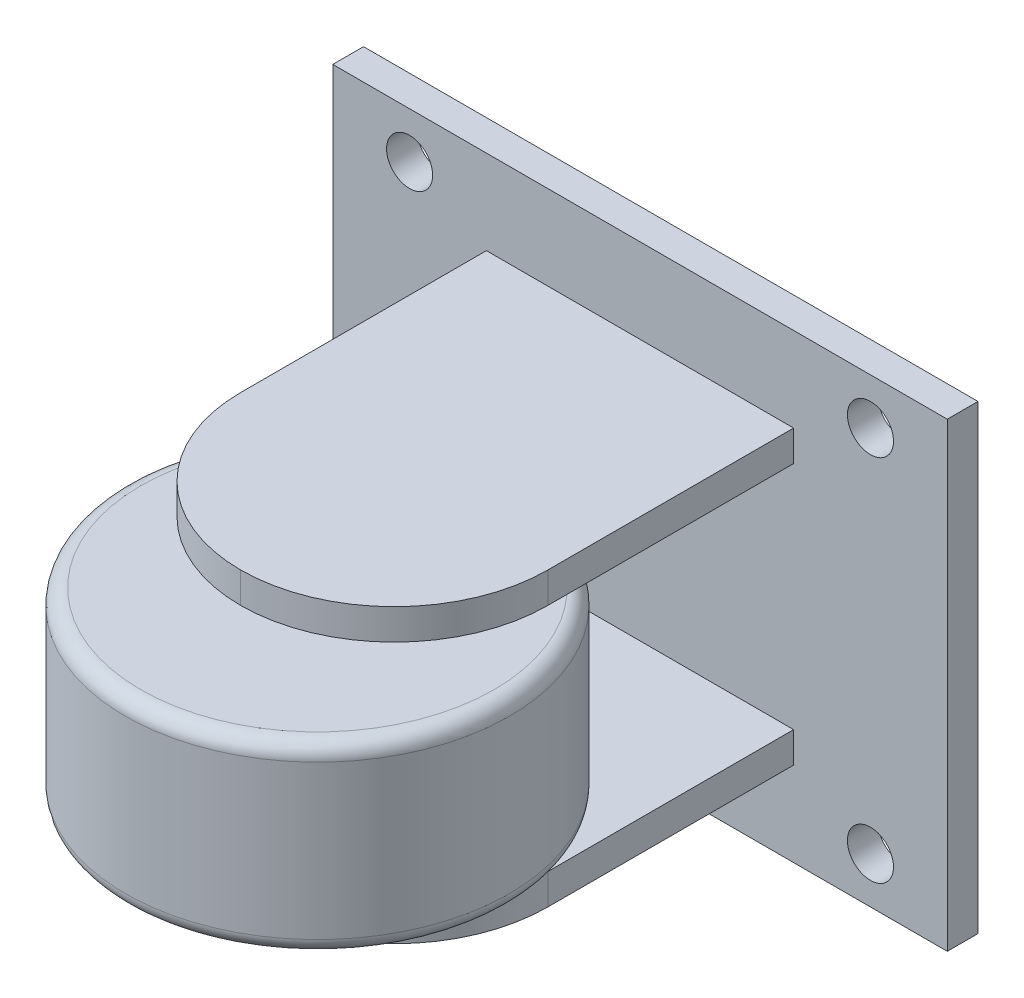
ISO-10303-21;
HEADER;
FILE_DESCRIPTION(('STEP AP214'),'2;1');
FILE_NAME('part.step','',(''),(''),'','','');
FILE_SCHEMA(('AUTOMOTIVE_DESIGN { 1 0 10303 214 1 1 1 1 }'));
ENDSEC;
DATA;
#1=APPLICATION_CONTEXT('core data for automotive mechanical design processes');
#2=APPLICATION_PROTOCOL_DEFINITION('international standard','automotive_design',2000,#1);
#3=PRODUCT_CONTEXT('',#1,'mechanical');
#4=PRODUCT('Part','Part','',(#3));
#5=PRODUCT_RELATED_PRODUCT_CATEGORY('part','',(#4));
#6=PRODUCT_DEFINITION_FORMATION('','',#4);
#7=PRODUCT_DEFINITION_CONTEXT('part definition',#1,'design');
#8=PRODUCT_DEFINITION('design','',#6,#7);
#9=PRODUCT_DEFINITION_SHAPE('','',#8);
#10=(LENGTH_UNIT() NAMED_UNIT(*) SI_UNIT(.MILLI.,.METRE.));
#11=(NAMED_UNIT(*) PLANE_ANGLE_UNIT() SI_UNIT($,.RADIAN.));
#12=(NAMED_UNIT(*) SI_UNIT($,.STERADIAN.) SOLID_ANGLE_UNIT());
#13=UNCERTAINTY_MEASURE_WITH_UNIT(LENGTH_MEASURE(1.E-05),#10,'distance_accuracy_value','');
#14=(GEOMETRIC_REPRESENTATION_CONTEXT(3) GLOBAL_UNCERTAINTY_ASSIGNED_CONTEXT((#13)) GLOBAL_UNIT_ASSIGNED_CONTEXT((#10,
#11,#12)) REPRESENTATION_CONTEXT('',''));
#15=CARTESIAN_POINT('',(0.,0.,0.));
#16=DIRECTION('',(0.,0.,1.));
#17=DIRECTION('',(1.,0.,0.));
#18=AXIS2_PLACEMENT_3D('',#15,#16,#17);
#19=CARTESIAN_POINT('',(0.,-16.5710678118655,23.));
#20=DIRECTION('',(0.,1.,0.));
#21=DIRECTION('',(0.,0.,1.));
#22=AXIS2_PLACEMENT_3D('',#19,#20,#21);
#23=CYLINDRICAL_SURFACE('',#22,2.5);
#24=CARTESIAN_POINT('',(0.,7.5,23.));
#25=DIRECTION('',(0.,1.,0.));
#26=DIRECTION('',(0.,0.,1.));
#27=AXIS2_PLACEMENT_3D('',#24,#25,#26);
#28=CIRCLE('',#27,2.5);
#29=CARTESIAN_POINT('',(0.,7.5,25.5));
#30=VERTEX_POINT('',#29);
#31=EDGE_CURVE('E241',#30,#30,#28,.T.);
#32=ORIENTED_EDGE('',*,*,#31,.F.);
#33=EDGE_LOOP('',(#32));
#34=FACE_BOUND('',#33,.T.);
#35=CARTESIAN_POINT('',(0.,6.,23.));
#36=DIRECTION('',(0.,-1.,0.));
#37=DIRECTION('',(0.,0.,-1.));
#38=AXIS2_PLACEMENT_3D('',#35,#36,#37);
#39=CIRCLE('',#38,2.5);
#40=CARTESIAN_POINT('',(0.,6.,20.5));
#41=VERTEX_POINT('',#40);
#42=EDGE_CURVE('E244',#41,#41,#39,.F.);
#43=ORIENTED_EDGE('',*,*,#42,.T.);
#44=EDGE_LOOP('',(#43));
#45=FACE_BOUND('',#44,.T.);
#46=ADVANCED_FACE('F35',(#34,#45),#23,.T.);
#47=CARTESIAN_POINT('',(0.,0.,2.));
#48=DIRECTION('',(0.,0.,-1.));
#49=DIRECTION('',(-1.,0.,0.));
#50=AXIS2_PLACEMENT_3D('',#47,#48,#49);
#51=PLANE('',#50);
#52=DIRECTION('',(0.,-1.,0.));
#53=VECTOR('',#52,1.);
#54=CARTESIAN_POINT('',(-10.,-7.5,2.));
#55=LINE('',#54,#53);
#56=CARTESIAN_POINT('',(-10.,-7.5,2.));
#57=VERTEX_POINT('',#56);
#58=CARTESIAN_POINT('',(-10.,-9.5,2.));
#59=VERTEX_POINT('',#58);
#60=EDGE_CURVE('E166',#57,#59,#55,.T.);
#61=ORIENTED_EDGE('',*,*,#60,.F.);
#62=DIRECTION('',(-1.,0.,0.));
#63=VECTOR('',#62,1.);
#64=CARTESIAN_POINT('',(-10.,-7.5,2.));
#65=LINE('',#64,#63);
#66=CARTESIAN_POINT('',(10.,-7.5,2.));
#67=VERTEX_POINT('',#66);
#68=EDGE_CURVE('E175',#67,#57,#65,.T.);
#69=ORIENTED_EDGE('',*,*,#68,.F.);
#70=DIRECTION('',(0.,1.,0.));
#71=VECTOR('',#70,1.);
#72=CARTESIAN_POINT('',(10.,-7.5,2.));
#73=LINE('',#72,#71);
#74=CARTESIAN_POINT('',(10.,-9.5,2.));
#75=VERTEX_POINT('',#74);
#76=EDGE_CURVE('E172',#75,#67,#73,.T.);
#77=ORIENTED_EDGE('',*,*,#76,.F.);
#78=DIRECTION('',(1.,0.,0.));
#79=VECTOR('',#78,1.);
#80=CARTESIAN_POINT('',(-10.,-9.5,2.));
#81=LINE('',#80,#79);
#82=EDGE_CURVE('E169',#59,#75,#81,.T.);
#83=ORIENTED_EDGE('',*,*,#82,.F.);
#84=EDGE_LOOP('',(#61,#69,#77,#83));
#85=FACE_BOUND('',#84,.T.);
#86=CARTESIAN_POINT('',(-15.,-12.,2.));
#87=DIRECTION('',(0.,0.,1.));
#88=DIRECTION('',(1.,0.,0.));
#89=AXIS2_PLACEMENT_3D('',#86,#87,#88);
#90=CIRCLE('',#89,1.5);
#91=CARTESIAN_POINT('',(-13.5,-12.,2.));
#92=VERTEX_POINT('',#91);
#93=EDGE_CURVE('E186',#92,#92,#90,.T.);
#94=ORIENTED_EDGE('',*,*,#93,.F.);
#95=EDGE_LOOP('',(#94));
#96=FACE_BOUND('',#95,.T.);
#97=CARTESIAN_POINT('',(15.,-12.,2.));
#98=DIRECTION('',(0.,0.,1.));
#99=DIRECTION('',(1.,0.,0.));
#100=AXIS2_PLACEMENT_3D('',#97,#98,#99);
#101=CIRCLE('',#100,1.5);
#102=CARTESIAN_POINT('',(16.5,-12.,2.));
#103=VERTEX_POINT('',#102);
#104=EDGE_CURVE('E197',#103,#103,#101,.T.);
#105=ORIENTED_EDGE('',*,*,#104,.F.);
#106=EDGE_LOOP('',(#105));
#107=FACE_BOUND('',#106,.T.);
#108=CARTESIAN_POINT('',(15.,12.,2.));
#109=DIRECTION('',(0.,0.,1.));
#110=DIRECTION('',(1.,0.,0.));
#111=AXIS2_PLACEMENT_3D('',#108,#109,#110);
#112=CIRCLE('',#111,1.5);
#113=CARTESIAN_POINT('',(16.5,12.,2.));
#114=VERTEX_POINT('',#113);
#115=EDGE_CURVE('E191',#114,#114,#112,.T.);
#116=ORIENTED_EDGE('',*,*,#115,.F.);
#117=EDGE_LOOP('',(#116));
#118=FACE_BOUND('',#117,.T.);
#119=CARTESIAN_POINT('',(-15.,12.,2.));
#120=DIRECTION('',(0.,0.,1.));
#121=DIRECTION('',(1.,0.,0.));
#122=AXIS2_PLACEMENT_3D('',#119,#120,#121);
#123=CIRCLE('',#122,1.5);
#124=CARTESIAN_POINT('',(-13.5,12.,2.));
#125=VERTEX_POINT('',#124);
#126=EDGE_CURVE('E190',#125,#125,#123,.T.);
#127=ORIENTED_EDGE('',*,*,#126,.F.);
#128=EDGE_LOOP('',(#127));
#129=FACE_BOUND('',#128,.T.);
#130=DIRECTION('',(0.,1.,0.));
#131=VECTOR('',#130,1.);
#132=CARTESIAN_POINT('',(20.,-15.,2.));
#133=LINE('',#132,#131);
#134=CARTESIAN_POINT('',(20.,-15.,2.));
#135=VERTEX_POINT('',#134);
#136=CARTESIAN_POINT('',(20.,15.,2.));
#137=VERTEX_POINT('',#136);
#138=EDGE_CURVE('E211',#135,#137,#133,.T.);
#139=ORIENTED_EDGE('',*,*,#138,.T.);
#140=DIRECTION('',(-1.,0.,0.));
#141=VECTOR('',#140,1.);
#142=CARTESIAN_POINT('',(-20.,15.,2.));
#143=LINE('',#142,#141);
#144=CARTESIAN_POINT('',(-20.,15.,2.));
#145=VERTEX_POINT('',#144);
#146=EDGE_CURVE('E214',#137,#145,#143,.T.);
#147=ORIENTED_EDGE('',*,*,#146,.T.);
#148=DIRECTION('',(0.,-1.,0.));
#149=VECTOR('',#148,1.);
#150=CARTESIAN_POINT('',(-20.,-15.,2.));
#151=LINE('',#150,#149);
#152=CARTESIAN_POINT('',(-20.,-15.,2.));
#153=VERTEX_POINT('',#152);
#154=EDGE_CURVE('E217',#145,#153,#151,.T.);
#155=ORIENTED_EDGE('',*,*,#154,.T.);
#156=DIRECTION('',(1.,0.,0.));
#157=VECTOR('',#156,1.);
#158=CARTESIAN_POINT('',(-20.,-15.,2.));
#159=LINE('',#158,#157);
#160=EDGE_CURVE('E219',#153,#135,#159,.T.);
#161=ORIENTED_EDGE('',*,*,#160,.T.);
#162=EDGE_LOOP('',(#139,#147,#155,#161));
#163=FACE_BOUND('',#162,.T.);
#164=DIRECTION('',(0.,1.,0.));
#165=VECTOR('',#164,1.);
#166=CARTESIAN_POINT('',(10.,7.5,2.));
#167=LINE('',#166,#165);
#168=CARTESIAN_POINT('',(10.,7.5,2.));
#169=VERTEX_POINT('',#168);
#170=CARTESIAN_POINT('',(10.,9.5,2.));
#171=VERTEX_POINT('',#170);
#172=EDGE_CURVE('E138',#169,#171,#167,.T.);
#173=ORIENTED_EDGE('',*,*,#172,.F.);
#174=DIRECTION('',(1.,0.,0.));
#175=VECTOR('',#174,1.);
#176=CARTESIAN_POINT('',(10.,7.5,2.));
#177=LINE('',#176,#175);
#178=CARTESIAN_POINT('',(-10.,7.5,2.));
#179=VERTEX_POINT('',#178);
#180=EDGE_CURVE('E143',#179,#169,#177,.T.);
#181=ORIENTED_EDGE('',*,*,#180,.F.);
#182=DIRECTION('',(0.,-1.,0.));
#183=VECTOR('',#182,1.);
#184=CARTESIAN_POINT('',(-10.,7.5,2.));
#185=LINE('',#184,#183);
#186=CARTESIAN_POINT('',(-10.,9.5,2.));
#187=VERTEX_POINT('',#186);
#188=EDGE_CURVE('E156',#187,#179,#185,.T.);
#189=ORIENTED_EDGE('',*,*,#188,.F.);
#190=DIRECTION('',(-1.,0.,0.));
#191=VECTOR('',#190,1.);
#192=CARTESIAN_POINT('',(10.,9.5,2.));
#193=LINE('',#192,#191);
#194=EDGE_CURVE('E152',#171,#187,#193,.T.);
#195=ORIENTED_EDGE('',*,*,#194,.F.);
#196=EDGE_LOOP('',(#173,#181,#189,#195));
#197=FACE_BOUND('',#196,.T.);
#198=ADVANCED_FACE('F148',(#85,#96,#107,#118,#129,#163,#197),#51,.F.);
#199=CARTESIAN_POINT('',(20.,-15.,2.));
#200=DIRECTION('',(-1.,0.,0.));
#201=DIRECTION('',(0.,0.,1.));
#202=AXIS2_PLACEMENT_3D('',#199,#200,#201);
#203=PLANE('',#202);
#204=DIRECTION('',(0.,1.,0.));
#205=VECTOR('',#204,1.);
#206=CARTESIAN_POINT('',(20.,-15.,0.));
#207=LINE('',#206,#205);
#208=CARTESIAN_POINT('',(20.,-15.,0.));
#209=VERTEX_POINT('',#208);
#210=CARTESIAN_POINT('',(20.,15.,0.));
#211=VERTEX_POINT('',#210);
#212=EDGE_CURVE('E208',#209,#211,#207,.T.);
#213=ORIENTED_EDGE('',*,*,#212,.T.);
#214=DIRECTION('',(0.,0.,-1.));
#215=VECTOR('',#214,1.);
#216=CARTESIAN_POINT('',(20.,15.,2.));
#217=LINE('',#216,#215);
#218=EDGE_CURVE('E237',#137,#211,#217,.T.);
#219=ORIENTED_EDGE('',*,*,#218,.F.);
#220=ORIENTED_EDGE('',*,*,#138,.F.);
#221=DIRECTION('',(0.,0.,-1.));
#222=VECTOR('',#221,1.);
#223=CARTESIAN_POINT('',(20.,-15.,2.));
#224=LINE('',#223,#222);
#225=EDGE_CURVE('E221',#135,#209,#224,.T.);
#226=ORIENTED_EDGE('',*,*,#225,.T.);
#227=EDGE_LOOP('',(#213,#219,#220,#226));
#228=FACE_BOUND('',#227,.T.);
#229=ADVANCED_FACE('F335',(#228),#203,.F.);
#230=CARTESIAN_POINT('',(-20.,15.,2.));
#231=DIRECTION('',(0.,-1.,0.));
#232=DIRECTION('',(0.,0.,-1.));
#233=AXIS2_PLACEMENT_3D('',#230,#231,#232);
#234=PLANE('',#233);
#235=DIRECTION('',(-1.,0.,0.));
#236=VECTOR('',#235,1.);
#237=CARTESIAN_POINT('',(-20.,15.,0.));
#238=LINE('',#237,#236);
#239=CARTESIAN_POINT('',(-20.,15.,0.));
#240=VERTEX_POINT('',#239);
#241=EDGE_CURVE('E224',#211,#240,#238,.T.);
#242=ORIENTED_EDGE('',*,*,#241,.T.);
#243=DIRECTION('',(0.,0.,-1.));
#244=VECTOR('',#243,1.);
#245=CARTESIAN_POINT('',(-20.,15.,2.));
#246=LINE('',#245,#244);
#247=EDGE_CURVE('E234',#145,#240,#246,.T.);
#248=ORIENTED_EDGE('',*,*,#247,.F.);
#249=ORIENTED_EDGE('',*,*,#146,.F.);
#250=ORIENTED_EDGE('',*,*,#218,.T.);
#251=EDGE_LOOP('',(#242,#248,#249,#250));
#252=FACE_BOUND('',#251,.T.);
#253=ADVANCED_FACE('F541',(#252),#234,.F.);
#254=CARTESIAN_POINT('',(-20.,-15.,2.));
#255=DIRECTION('',(1.,0.,0.));
#256=DIRECTION('',(0.,0.,-1.));
#257=AXIS2_PLACEMENT_3D('',#254,#255,#256);
#258=PLANE('',#257);
#259=DIRECTION('',(0.,-1.,0.));
#260=VECTOR('',#259,1.);
#261=CARTESIAN_POINT('',(-20.,-15.,0.));
#262=LINE('',#261,#260);
#263=CARTESIAN_POINT('',(-20.,-15.,0.));
#264=VERTEX_POINT('',#263);
#265=EDGE_CURVE('E226',#240,#264,#262,.T.);
#266=ORIENTED_EDGE('',*,*,#265,.T.);
#267=DIRECTION('',(0.,0.,-1.));
#268=VECTOR('',#267,1.);
#269=CARTESIAN_POINT('',(-20.,-15.,2.));
#270=LINE('',#269,#268);
#271=EDGE_CURVE('E231',#153,#264,#270,.T.);
#272=ORIENTED_EDGE('',*,*,#271,.F.);
#273=ORIENTED_EDGE('',*,*,#154,.F.);
#274=ORIENTED_EDGE('',*,*,#247,.T.);
#275=EDGE_LOOP('',(#266,#272,#273,#274));
#276=FACE_BOUND('',#275,.T.);
#277=ADVANCED_FACE('F531',(#276),#258,.F.);
#278=CARTESIAN_POINT('',(-20.,-15.,2.));
#279=DIRECTION('',(0.,1.,0.));
#280=DIRECTION('',(0.,0.,1.));
#281=AXIS2_PLACEMENT_3D('',#278,#279,#280);
#282=PLANE('',#281);
#283=DIRECTION('',(1.,0.,0.));
#284=VECTOR('',#283,1.);
#285=CARTESIAN_POINT('',(-20.,-15.,0.));
#286=LINE('',#285,#284);
#287=EDGE_CURVE('E215',#264,#209,#286,.T.);
#288=ORIENTED_EDGE('',*,*,#287,.T.);
#289=ORIENTED_EDGE('',*,*,#225,.F.);
#290=ORIENTED_EDGE('',*,*,#160,.F.);
#291=ORIENTED_EDGE('',*,*,#271,.T.);
#292=EDGE_LOOP('',(#288,#289,#290,#291));
#293=FACE_BOUND('',#292,.T.);
#294=ADVANCED_FACE('F521',(#293),#282,.F.);
#295=CARTESIAN_POINT('',(0.,0.,0.));
#296=DIRECTION('',(0.,0.,-1.));
#297=DIRECTION('',(-1.,0.,0.));
#298=AXIS2_PLACEMENT_3D('',#295,#296,#297);
#299=PLANE('',#298);
#300=CARTESIAN_POINT('',(-15.,-12.,0.));
#301=DIRECTION('',(0.,0.,1.));
#302=DIRECTION('',(1.,0.,0.));
#303=AXIS2_PLACEMENT_3D('',#300,#301,#302);
#304=CIRCLE('',#303,1.5);
#305=CARTESIAN_POINT('',(-13.5,-12.,0.));
#306=VERTEX_POINT('',#305);
#307=EDGE_CURVE('E200',#306,#306,#304,.T.);
#308=ORIENTED_EDGE('',*,*,#307,.T.);
#309=EDGE_LOOP('',(#308));
#310=FACE_BOUND('',#309,.T.);
#311=CARTESIAN_POINT('',(15.,-12.,0.));
#312=DIRECTION('',(0.,0.,1.));
#313=DIRECTION('',(1.,0.,0.));
#314=AXIS2_PLACEMENT_3D('',#311,#312,#313);
#315=CIRCLE('',#314,1.5);
#316=CARTESIAN_POINT('',(16.5,-12.,0.));
#317=VERTEX_POINT('',#316);
#318=EDGE_CURVE('E194',#317,#317,#315,.T.);
#319=ORIENTED_EDGE('',*,*,#318,.T.);
#320=EDGE_LOOP('',(#319));
#321=FACE_BOUND('',#320,.T.);
#322=CARTESIAN_POINT('',(15.,12.,0.));
#323=DIRECTION('',(0.,0.,1.));
#324=DIRECTION('',(1.,0.,0.));
#325=AXIS2_PLACEMENT_3D('',#322,#323,#324);
#326=CIRCLE('',#325,1.5);
#327=CARTESIAN_POINT('',(16.5,12.,0.));
#328=VERTEX_POINT('',#327);
#329=EDGE_CURVE('E187',#328,#328,#326,.T.);
#330=ORIENTED_EDGE('',*,*,#329,.T.);
#331=EDGE_LOOP('',(#330));
#332=FACE_BOUND('',#331,.T.);
#333=CARTESIAN_POINT('',(-15.,12.,0.));
#334=DIRECTION('',(0.,0.,1.));
#335=DIRECTION('',(1.,0.,0.));
#336=AXIS2_PLACEMENT_3D('',#333,#334,#335);
#337=CIRCLE('',#336,1.5);
#338=CARTESIAN_POINT('',(-13.5,12.,0.));
#339=VERTEX_POINT('',#338);
#340=EDGE_CURVE('E205',#339,#339,#337,.T.);
#341=ORIENTED_EDGE('',*,*,#340,.T.);
#342=EDGE_LOOP('',(#341));
#343=FACE_BOUND('',#342,.T.);
#344=ORIENTED_EDGE('',*,*,#212,.F.);
#345=ORIENTED_EDGE('',*,*,#287,.F.);
#346=ORIENTED_EDGE('',*,*,#265,.F.);
#347=ORIENTED_EDGE('',*,*,#241,.F.);
#348=EDGE_LOOP('',(#344,#345,#346,#347));
#349=FACE_BOUND('',#348,.T.);
#350=ADVANCED_FACE('F511',(#310,#321,#332,#343,#349),#299,.T.);
#351=CARTESIAN_POINT('',(-15.,12.,0.));
#352=DIRECTION('',(0.,0.,1.));
#353=DIRECTION('',(1.,0.,0.));
#354=AXIS2_PLACEMENT_3D('',#351,#352,#353);
#355=CYLINDRICAL_SURFACE('',#354,1.5);
#356=ORIENTED_EDGE('',*,*,#340,.F.);
#357=EDGE_LOOP('',(#356));
#358=FACE_BOUND('',#357,.T.);
#359=ORIENTED_EDGE('',*,*,#126,.T.);
#360=EDGE_LOOP('',(#359));
#361=FACE_BOUND('',#360,.T.);
#362=ADVANCED_FACE('F501',(#358,#361),#355,.F.);
#363=CARTESIAN_POINT('',(15.,12.,0.));
#364=DIRECTION('',(0.,0.,1.));
#365=DIRECTION('',(1.,0.,0.));
#366=AXIS2_PLACEMENT_3D('',#363,#364,#365);
#367=CYLINDRICAL_SURFACE('',#366,1.5);
#368=ORIENTED_EDGE('',*,*,#329,.F.);
#369=EDGE_LOOP('',(#368));
#370=FACE_BOUND('',#369,.T.);
#371=ORIENTED_EDGE('',*,*,#115,.T.);
#372=EDGE_LOOP('',(#371));
#373=FACE_BOUND('',#372,.T.);
#374=ADVANCED_FACE('F491',(#370,#373),#367,.F.);
#375=CARTESIAN_POINT('',(15.,-12.,0.));
#376=DIRECTION('',(0.,0.,1.));
#377=DIRECTION('',(1.,0.,0.));
#378=AXIS2_PLACEMENT_3D('',#375,#376,#377);
#379=CYLINDRICAL_SURFACE('',#378,1.5);
#380=ORIENTED_EDGE('',*,*,#318,.F.);
#381=EDGE_LOOP('',(#380));
#382=FACE_BOUND('',#381,.T.);
#383=ORIENTED_EDGE('',*,*,#104,.T.);
#384=EDGE_LOOP('',(#383));
#385=FACE_BOUND('',#384,.T.);
#386=ADVANCED_FACE('F481',(#382,#385),#379,.F.);
#387=CARTESIAN_POINT('',(-15.,-12.,0.));
#388=DIRECTION('',(0.,0.,1.));
#389=DIRECTION('',(1.,0.,0.));
#390=AXIS2_PLACEMENT_3D('',#387,#388,#389);
#391=CYLINDRICAL_SURFACE('',#390,1.5);
#392=ORIENTED_EDGE('',*,*,#307,.F.);
#393=EDGE_LOOP('',(#392));
#394=FACE_BOUND('',#393,.T.);
#395=ORIENTED_EDGE('',*,*,#93,.T.);
#396=EDGE_LOOP('',(#395));
#397=FACE_BOUND('',#396,.T.);
#398=ADVANCED_FACE('F454',(#394,#397),#391,.F.);
#399=CARTESIAN_POINT('',(-10.,-7.5,28.));
#400=DIRECTION('',(1.,0.,0.));
#401=DIRECTION('',(0.,0.,-1.));
#402=AXIS2_PLACEMENT_3D('',#399,#400,#401);
#403=PLANE('',#402);
#404=DIRECTION('',(0.,0.,-1.));
#405=VECTOR('',#404,1.);
#406=CARTESIAN_POINT('',(-10.,-9.5,28.));
#407=LINE('',#406,#405);
#408=CARTESIAN_POINT('',(-10.,-9.5,18.));
#409=VERTEX_POINT('',#408);
#410=EDGE_CURVE('E184',#409,#59,#407,.T.);
#411=ORIENTED_EDGE('',*,*,#410,.F.);
#412=DIRECTION('',(0.,-1.,0.));
#413=VECTOR('',#412,1.);
#414=CARTESIAN_POINT('',(-9.99999999999999,-7.5,18.));
#415=LINE('',#414,#413);
#416=CARTESIAN_POINT('',(-10.,-7.5,18.));
#417=VERTEX_POINT('',#416);
#418=EDGE_CURVE('E261',#409,#417,#415,.F.);
#419=ORIENTED_EDGE('',*,*,#418,.T.);
#420=DIRECTION('',(0.,0.,-1.));
#421=VECTOR('',#420,1.);
#422=CARTESIAN_POINT('',(-10.,-7.5,28.));
#423=LINE('',#422,#421);
#424=EDGE_CURVE('E178',#417,#57,#423,.T.);
#425=ORIENTED_EDGE('',*,*,#424,.T.);
#426=ORIENTED_EDGE('',*,*,#60,.T.);
#427=EDGE_LOOP('',(#411,#419,#425,#426));
#428=FACE_BOUND('',#427,.T.);
#429=ADVANCED_FACE('F444',(#428),#403,.F.);
#430=CARTESIAN_POINT('',(-10.,-9.5,28.));
#431=DIRECTION('',(0.,1.,0.));
#432=DIRECTION('',(0.,0.,1.));
#433=AXIS2_PLACEMENT_3D('',#430,#431,#432);
#434=PLANE('',#433);
#435=DIRECTION('',(0.,0.,-1.));
#436=VECTOR('',#435,1.);
#437=CARTESIAN_POINT('',(10.,-9.5,28.));
#438=LINE('',#437,#436);
#439=CARTESIAN_POINT('',(10.,-9.5,18.));
#440=VERTEX_POINT('',#439);
#441=EDGE_CURVE('E182',#440,#75,#438,.T.);
#442=ORIENTED_EDGE('',*,*,#441,.F.);
#443=CARTESIAN_POINT('',(0.,-9.5,18.));
#444=DIRECTION('',(0.,1.,0.));
#445=DIRECTION('',(0.,0.,1.));
#446=AXIS2_PLACEMENT_3D('',#443,#444,#445);
#447=CIRCLE('',#446,10.);
#448=CARTESIAN_POINT('',(0.,-9.5,28.));
#449=VERTEX_POINT('',#448);
#450=EDGE_CURVE('E259',#440,#449,#447,.F.);
#451=ORIENTED_EDGE('',*,*,#450,.T.);
#452=CARTESIAN_POINT('',(0.,-9.5,18.));
#453=DIRECTION('',(0.,1.,0.));
#454=DIRECTION('',(0.,0.,1.));
#455=AXIS2_PLACEMENT_3D('',#452,#453,#454);
#456=CIRCLE('',#455,10.);
#457=EDGE_CURVE('E257',#449,#409,#456,.F.);
#458=ORIENTED_EDGE('',*,*,#457,.T.);
#459=ORIENTED_EDGE('',*,*,#410,.T.);
#460=ORIENTED_EDGE('',*,*,#82,.T.);
#461=EDGE_LOOP('',(#442,#451,#458,#459,#460));
#462=FACE_BOUND('',#461,.T.);
#463=ADVANCED_FACE('F434',(#462),#434,.F.);
#464=CARTESIAN_POINT('',(10.,-7.5,28.));
#465=DIRECTION('',(-1.,0.,0.));
#466=DIRECTION('',(0.,0.,1.));
#467=AXIS2_PLACEMENT_3D('',#464,#465,#466);
#468=PLANE('',#467);
#469=DIRECTION('',(0.,0.,-1.));
#470=VECTOR('',#469,1.);
#471=CARTESIAN_POINT('',(10.,-7.5,28.));
#472=LINE('',#471,#470);
#473=CARTESIAN_POINT('',(10.,-7.5,18.));
#474=VERTEX_POINT('',#473);
#475=EDGE_CURVE('E180',#474,#67,#472,.T.);
#476=ORIENTED_EDGE('',*,*,#475,.F.);
#477=DIRECTION('',(0.,1.,0.));
#478=VECTOR('',#477,1.);
#479=CARTESIAN_POINT('',(10.,-9.5,18.));
#480=LINE('',#479,#478);
#481=EDGE_CURVE('E254',#474,#440,#480,.F.);
#482=ORIENTED_EDGE('',*,*,#481,.T.);
#483=ORIENTED_EDGE('',*,*,#441,.T.);
#484=ORIENTED_EDGE('',*,*,#76,.T.);
#485=EDGE_LOOP('',(#476,#482,#483,#484));
#486=FACE_BOUND('',#485,.T.);
#487=ADVANCED_FACE('F425',(#486),#468,.F.);
#488=CARTESIAN_POINT('',(-10.,-7.5,28.));
#489=DIRECTION('',(0.,-1.,0.));
#490=DIRECTION('',(0.,0.,-1.));
#491=AXIS2_PLACEMENT_3D('',#488,#489,#490);
#492=PLANE('',#491);
#493=CARTESIAN_POINT('',(0.,-7.5,23.));
#494=DIRECTION('',(0.,-1.,0.));
#495=DIRECTION('',(0.,0.,-1.));
#496=AXIS2_PLACEMENT_3D('',#493,#494,#495);
#497=CIRCLE('',#496,2.5);
#498=CARTESIAN_POINT('',(0.,-7.5,20.5));
#499=VERTEX_POINT('',#498);
#500=EDGE_CURVE('E153',#499,#499,#497,.T.);
#501=ORIENTED_EDGE('',*,*,#500,.T.);
#502=EDGE_LOOP('',(#501));
#503=FACE_BOUND('',#502,.T.);
#504=CARTESIAN_POINT('',(0.,-7.5,18.));
#505=DIRECTION('',(0.,-1.,0.));
#506=DIRECTION('',(0.,0.,-1.));
#507=AXIS2_PLACEMENT_3D('',#504,#505,#506);
#508=CIRCLE('',#507,10.);
#509=CARTESIAN_POINT('',(0.,-7.5,28.));
#510=VERTEX_POINT('',#509);
#511=EDGE_CURVE('E250',#417,#510,#508,.F.);
#512=ORIENTED_EDGE('',*,*,#511,.T.);
#513=CARTESIAN_POINT('',(0.,-7.5,18.));
#514=DIRECTION('',(0.,-1.,0.));
#515=DIRECTION('',(0.,0.,-1.));
#516=AXIS2_PLACEMENT_3D('',#513,#514,#515);
#517=CIRCLE('',#516,10.);
#518=EDGE_CURVE('E252',#510,#474,#517,.F.);
#519=ORIENTED_EDGE('',*,*,#518,.T.);
#520=ORIENTED_EDGE('',*,*,#475,.T.);
#521=ORIENTED_EDGE('',*,*,#68,.T.);
#522=ORIENTED_EDGE('',*,*,#424,.F.);
#523=EDGE_LOOP('',(#512,#519,#520,#521,#522));
#524=FACE_BOUND('',#523,.T.);
#525=ADVANCED_FACE('F416',(#503,#524),#492,.F.);
#526=CARTESIAN_POINT('',(10.,7.5,28.));
#527=DIRECTION('',(-1.,0.,0.));
#528=DIRECTION('',(0.,0.,1.));
#529=AXIS2_PLACEMENT_3D('',#526,#527,#528);
#530=PLANE('',#529);
#531=DIRECTION('',(0.,0.,-1.));
#532=VECTOR('',#531,1.);
#533=CARTESIAN_POINT('',(10.,9.5,28.));
#534=LINE('',#533,#532);
#535=CARTESIAN_POINT('',(10.,9.5,18.));
#536=VERTEX_POINT('',#535);
#537=EDGE_CURVE('E164',#536,#171,#534,.T.);
#538=ORIENTED_EDGE('',*,*,#537,.F.);
#539=DIRECTION('',(0.,1.,0.));
#540=VECTOR('',#539,1.);
#541=CARTESIAN_POINT('',(10.,7.5,18.));
#542=LINE('',#541,#540);
#543=CARTESIAN_POINT('',(10.,7.5,18.));
#544=VERTEX_POINT('',#543);
#545=EDGE_CURVE('E140',#536,#544,#542,.F.);
#546=ORIENTED_EDGE('',*,*,#545,.T.);
#547=DIRECTION('',(0.,0.,-1.));
#548=VECTOR('',#547,1.);
#549=CARTESIAN_POINT('',(10.,7.5,28.));
#550=LINE('',#549,#548);
#551=EDGE_CURVE('E134',#544,#169,#550,.T.);
#552=ORIENTED_EDGE('',*,*,#551,.T.);
#553=ORIENTED_EDGE('',*,*,#172,.T.);
#554=EDGE_LOOP('',(#538,#546,#552,#553));
#555=FACE_BOUND('',#554,.T.);
#556=ADVANCED_FACE('F137',(#555),#530,.F.);
#557=CARTESIAN_POINT('',(10.,9.5,28.));
#558=DIRECTION('',(0.,-1.,0.));
#559=DIRECTION('',(0.,0.,-1.));
#560=AXIS2_PLACEMENT_3D('',#557,#558,#559);
#561=PLANE('',#560);
#562=CARTESIAN_POINT('',(0.,9.5,18.));
#563=DIRECTION('',(0.,-1.,0.));
#564=DIRECTION('',(0.,0.,-1.));
#565=AXIS2_PLACEMENT_3D('',#562,#563,#564);
#566=CIRCLE('',#565,10.);
#567=CARTESIAN_POINT('',(-10.,9.5,18.));
#568=VERTEX_POINT('',#567);
#569=CARTESIAN_POINT('',(0.,9.5,28.));
#570=VERTEX_POINT('',#569);
#571=EDGE_CURVE('E263',#568,#570,#566,.F.);
#572=ORIENTED_EDGE('',*,*,#571,.T.);
#573=CARTESIAN_POINT('',(0.,9.5,18.));
#574=DIRECTION('',(0.,-1.,0.));
#575=DIRECTION('',(0.,0.,-1.));
#576=AXIS2_PLACEMENT_3D('',#573,#574,#575);
#577=CIRCLE('',#576,10.);
#578=EDGE_CURVE('E265',#570,#536,#577,.F.);
#579=ORIENTED_EDGE('',*,*,#578,.T.);
#580=ORIENTED_EDGE('',*,*,#537,.T.);
#581=ORIENTED_EDGE('',*,*,#194,.T.);
#582=DIRECTION('',(0.,0.,-1.));
#583=VECTOR('',#582,1.);
#584=CARTESIAN_POINT('',(-10.,9.5,28.));
#585=LINE('',#584,#583);
#586=EDGE_CURVE('E162',#568,#187,#585,.T.);
#587=ORIENTED_EDGE('',*,*,#586,.F.);
#588=EDGE_LOOP('',(#572,#579,#580,#581,#587));
#589=FACE_BOUND('',#588,.T.);
#590=ADVANCED_FACE('F311',(#589),#561,.F.);
#591=CARTESIAN_POINT('',(-10.,7.5,28.));
#592=DIRECTION('',(1.,0.,0.));
#593=DIRECTION('',(0.,0.,-1.));
#594=AXIS2_PLACEMENT_3D('',#591,#592,#593);
#595=PLANE('',#594);
#596=DIRECTION('',(0.,0.,-1.));
#597=VECTOR('',#596,1.);
#598=CARTESIAN_POINT('',(-10.,7.5,28.));
#599=LINE('',#598,#597);
#600=CARTESIAN_POINT('',(-10.,7.5,18.));
#601=VERTEX_POINT('',#600);
#602=EDGE_CURVE('E142',#601,#179,#599,.T.);
#603=ORIENTED_EDGE('',*,*,#602,.F.);
#604=DIRECTION('',(0.,-1.,0.));
#605=VECTOR('',#604,1.);
#606=CARTESIAN_POINT('',(-10.,9.5,18.));
#607=LINE('',#606,#605);
#608=EDGE_CURVE('E270',#601,#568,#607,.F.);
#609=ORIENTED_EDGE('',*,*,#608,.T.);
#610=ORIENTED_EDGE('',*,*,#586,.T.);
#611=ORIENTED_EDGE('',*,*,#188,.T.);
#612=EDGE_LOOP('',(#603,#609,#610,#611));
#613=FACE_BOUND('',#612,.T.);
#614=ADVANCED_FACE('F320',(#613),#595,.F.);
#615=CARTESIAN_POINT('',(10.,7.5,28.));
#616=DIRECTION('',(0.,1.,0.));
#617=DIRECTION('',(0.,0.,1.));
#618=AXIS2_PLACEMENT_3D('',#615,#616,#617);
#619=PLANE('',#618);
#620=ORIENTED_EDGE('',*,*,#31,.T.);
#621=EDGE_LOOP('',(#620));
#622=FACE_BOUND('',#621,.T.);
#623=ORIENTED_EDGE('',*,*,#551,.F.);
#624=CARTESIAN_POINT('',(0.,7.5,18.));
#625=DIRECTION('',(0.,1.,0.));
#626=DIRECTION('',(0.,0.,1.));
#627=AXIS2_PLACEMENT_3D('',#624,#625,#626);
#628=CIRCLE('',#627,10.);
#629=CARTESIAN_POINT('',(0.,7.5,28.));
#630=VERTEX_POINT('',#629);
#631=EDGE_CURVE('E55',#544,#630,#628,.F.);
#632=ORIENTED_EDGE('',*,*,#631,.T.);
#633=CARTESIAN_POINT('',(0.,7.5,18.));
#634=DIRECTION('',(0.,1.,0.));
#635=DIRECTION('',(0.,0.,1.));
#636=AXIS2_PLACEMENT_3D('',#633,#634,#635);
#637=CIRCLE('',#636,10.);
#638=EDGE_CURVE('E50',#630,#601,#637,.F.);
#639=ORIENTED_EDGE('',*,*,#638,.T.);
#640=ORIENTED_EDGE('',*,*,#602,.T.);
#641=ORIENTED_EDGE('',*,*,#180,.T.);
#642=EDGE_LOOP('',(#623,#632,#639,#640,#641));
#643=FACE_BOUND('',#642,.T.);
#644=ADVANCED_FACE('F155',(#622,#643),#619,.F.);
#645=CARTESIAN_POINT('',(0.,-6.,23.));
#646=DIRECTION('',(0.,-1.,0.));
#647=DIRECTION('',(0.,0.,-1.));
#648=AXIS2_PLACEMENT_3D('',#645,#646,#647);
#649=CIRCLE('',#648,2.5);
#650=CARTESIAN_POINT('',(0.,-6.,20.5));
#651=VERTEX_POINT('',#650);
#652=EDGE_CURVE('E240',#651,#651,#649,.F.);
#653=ORIENTED_EDGE('',*,*,#652,.F.);
#654=EDGE_LOOP('',(#653));
#655=FACE_BOUND('',#654,.T.);
#656=ORIENTED_EDGE('',*,*,#500,.F.);
#657=EDGE_LOOP('',(#656));
#658=FACE_BOUND('',#657,.T.);
#659=ADVANCED_FACE('F301',(#655,#658),#23,.T.);
#660=CARTESIAN_POINT('',(0.,-6.,23.));
#661=DIRECTION('',(0.,1.,0.));
#662=DIRECTION('',(0.,0.,1.));
#663=AXIS2_PLACEMENT_3D('',#660,#661,#662);
#664=CYLINDRICAL_SURFACE('',#663,12.5);
#665=CARTESIAN_POINT('',(0.,-5.,23.));
#666=DIRECTION('',(0.,-1.,0.));
#667=DIRECTION('',(0.,0.,-1.));
#668=AXIS2_PLACEMENT_3D('',#665,#666,#667);
#669=CIRCLE('',#668,12.5);
#670=CARTESIAN_POINT('',(0.,-5.,10.5));
#671=VERTEX_POINT('',#670);
#672=EDGE_CURVE('E43',#671,#671,#669,.F.);
#673=ORIENTED_EDGE('',*,*,#672,.T.);
#674=EDGE_LOOP('',(#673));
#675=FACE_BOUND('',#674,.T.);
#676=CARTESIAN_POINT('',(0.,5.,23.));
#677=DIRECTION('',(0.,-1.,0.));
#678=DIRECTION('',(0.,0.,-1.));
#679=AXIS2_PLACEMENT_3D('',#676,#677,#678);
#680=CIRCLE('',#679,12.5);
#681=CARTESIAN_POINT('',(0.,5.,10.5));
#682=VERTEX_POINT('',#681);
#683=EDGE_CURVE('E280',#682,#682,#680,.T.);
#684=ORIENTED_EDGE('',*,*,#683,.T.);
#685=EDGE_LOOP('',(#684));
#686=FACE_BOUND('',#685,.T.);
#687=ADVANCED_FACE('F285',(#675,#686),#664,.T.);
#688=CARTESIAN_POINT('',(0.,-6.,23.));
#689=DIRECTION('',(0.,-1.,0.));
#690=DIRECTION('',(0.,0.,-1.));
#691=AXIS2_PLACEMENT_3D('',#688,#689,#690);
#692=PLANE('',#691);
#693=CARTESIAN_POINT('',(0.,-6.,23.));
#694=DIRECTION('',(0.,-1.,0.));
#695=DIRECTION('',(0.,0.,-1.));
#696=AXIS2_PLACEMENT_3D('',#693,#694,#695);
#697=CIRCLE('',#696,11.5);
#698=CARTESIAN_POINT('',(0.,-6.,11.5));
#699=VERTEX_POINT('',#698);
#700=EDGE_CURVE('E272',#699,#699,#697,.T.);
#701=ORIENTED_EDGE('',*,*,#700,.T.);
#702=EDGE_LOOP('',(#701));
#703=FACE_BOUND('',#702,.T.);
#704=ORIENTED_EDGE('',*,*,#652,.T.);
#705=EDGE_LOOP('',(#704));
#706=FACE_BOUND('',#705,.T.);
#707=ADVANCED_FACE('F294',(#703,#706),#692,.T.);
#708=CARTESIAN_POINT('',(0.,6.,23.));
#709=DIRECTION('',(0.,-1.,0.));
#710=DIRECTION('',(0.,0.,-1.));
#711=AXIS2_PLACEMENT_3D('',#708,#709,#710);
#712=PLANE('',#711);
#713=CARTESIAN_POINT('',(0.,6.,23.));
#714=DIRECTION('',(0.,-1.,0.));
#715=DIRECTION('',(0.,0.,-1.));
#716=AXIS2_PLACEMENT_3D('',#713,#714,#715);
#717=CIRCLE('',#716,11.5);
#718=CARTESIAN_POINT('',(0.,6.,11.5));
#719=VERTEX_POINT('',#718);
#720=EDGE_CURVE('E11',#719,#719,#717,.F.);
#721=ORIENTED_EDGE('',*,*,#720,.T.);
#722=EDGE_LOOP('',(#721));
#723=FACE_BOUND('',#722,.T.);
#724=ORIENTED_EDGE('',*,*,#42,.F.);
#725=EDGE_LOOP('',(#724));
#726=FACE_BOUND('',#725,.T.);
#727=ADVANCED_FACE('F297',(#723,#726),#712,.F.);
#728=CARTESIAN_POINT('',(0.,0.,18.));
#729=DIRECTION('',(0.,1.,0.));
#730=DIRECTION('',(0.,0.,1.));
#731=AXIS2_PLACEMENT_3D('',#728,#729,#730);
#732=CYLINDRICAL_SURFACE('',#731,10.);
#733=ORIENTED_EDGE('',*,*,#418,.F.);
#734=ORIENTED_EDGE('',*,*,#457,.F.);
#735=DIRECTION('',(0.,-1.,0.));
#736=VECTOR('',#735,1.);
#737=CARTESIAN_POINT('',(0.,-9.5,28.));
#738=LINE('',#737,#736);
#739=EDGE_CURVE('E247',#510,#449,#738,.T.);
#740=ORIENTED_EDGE('',*,*,#739,.F.);
#741=ORIENTED_EDGE('',*,*,#511,.F.);
#742=EDGE_LOOP('',(#733,#734,#740,#741));
#743=FACE_BOUND('',#742,.T.);
#744=ADVANCED_FACE('F344',(#743),#732,.T.);
#745=CARTESIAN_POINT('',(0.,0.,18.));
#746=DIRECTION('',(0.,-1.,0.));
#747=DIRECTION('',(0.,0.,-1.));
#748=AXIS2_PLACEMENT_3D('',#745,#746,#747);
#749=CYLINDRICAL_SURFACE('',#748,10.);
#750=ORIENTED_EDGE('',*,*,#450,.F.);
#751=ORIENTED_EDGE('',*,*,#481,.F.);
#752=ORIENTED_EDGE('',*,*,#518,.F.);
#753=ORIENTED_EDGE('',*,*,#739,.T.);
#754=EDGE_LOOP('',(#750,#751,#752,#753));
#755=FACE_BOUND('',#754,.T.);
#756=ADVANCED_FACE('F349',(#755),#749,.T.);
#757=CARTESIAN_POINT('',(0.,0.,18.));
#758=DIRECTION('',(0.,1.,0.));
#759=DIRECTION('',(0.,0.,1.));
#760=AXIS2_PLACEMENT_3D('',#757,#758,#759);
#761=CYLINDRICAL_SURFACE('',#760,10.);
#762=ORIENTED_EDGE('',*,*,#608,.F.);
#763=ORIENTED_EDGE('',*,*,#638,.F.);
#764=DIRECTION('',(0.,-1.,0.));
#765=VECTOR('',#764,1.);
#766=CARTESIAN_POINT('',(0.,7.5,28.));
#767=LINE('',#766,#765);
#768=EDGE_CURVE('E275',#570,#630,#767,.T.);
#769=ORIENTED_EDGE('',*,*,#768,.F.);
#770=ORIENTED_EDGE('',*,*,#571,.F.);
#771=EDGE_LOOP('',(#762,#763,#769,#770));
#772=FACE_BOUND('',#771,.T.);
#773=ADVANCED_FACE('F318',(#772),#761,.T.);
#774=CARTESIAN_POINT('',(0.,0.,18.));
#775=DIRECTION('',(0.,-1.,0.));
#776=DIRECTION('',(0.,0.,-1.));
#777=AXIS2_PLACEMENT_3D('',#774,#775,#776);
#778=CYLINDRICAL_SURFACE('',#777,10.);
#779=ORIENTED_EDGE('',*,*,#631,.F.);
#780=ORIENTED_EDGE('',*,*,#545,.F.);
#781=ORIENTED_EDGE('',*,*,#578,.F.);
#782=ORIENTED_EDGE('',*,*,#768,.T.);
#783=EDGE_LOOP('',(#779,#780,#781,#782));
#784=FACE_BOUND('',#783,.T.);
#785=ADVANCED_FACE('F291',(#784),#778,.T.);
#786=CARTESIAN_POINT('',(0.,-5.,23.));
#787=DIRECTION('',(0.,-1.,0.));
#788=DIRECTION('',(0.,0.,-1.));
#789=AXIS2_PLACEMENT_3D('',#786,#787,#788);
#790=TOROIDAL_SURFACE('',#789,11.5,1.);
#791=ORIENTED_EDGE('',*,*,#672,.F.);
#792=EDGE_LOOP('',(#791));
#793=FACE_BOUND('',#792,.T.);
#794=ORIENTED_EDGE('',*,*,#700,.F.);
#795=EDGE_LOOP('',(#794));
#796=FACE_BOUND('',#795,.T.);
#797=ADVANCED_FACE('F288',(#793,#796),#790,.T.);
#798=CARTESIAN_POINT('',(0.,5.,23.));
#799=DIRECTION('',(0.,-1.,0.));
#800=DIRECTION('',(0.,0.,-1.));
#801=AXIS2_PLACEMENT_3D('',#798,#799,#800);
#802=TOROIDAL_SURFACE('',#801,11.5,1.);
#803=ORIENTED_EDGE('',*,*,#720,.F.);
#804=EDGE_LOOP('',(#803));
#805=FACE_BOUND('',#804,.T.);
#806=ORIENTED_EDGE('',*,*,#683,.F.);
#807=EDGE_LOOP('',(#806));
#808=FACE_BOUND('',#807,.T.);
#809=ADVANCED_FACE('F37',(#805,#808),#802,.T.);
#810=CLOSED_SHELL('',(#46,#198,#229,#253,#277,#294,#350,#362,#374,#386,#398,#429,#463,#487,#525,
#556,#590,#614,#644,#659,#687,#707,#727,#744,#756,#773,#785,#797,#809));
#811=MANIFOLD_SOLID_BREP('B2',#810);
#812=ADVANCED_BREP_SHAPE_REPRESENTATION('',(#18,#811),#14);
#813=SHAPE_DEFINITION_REPRESENTATION(#9,#812);
ENDSEC;
END-ISO-10303-21;
